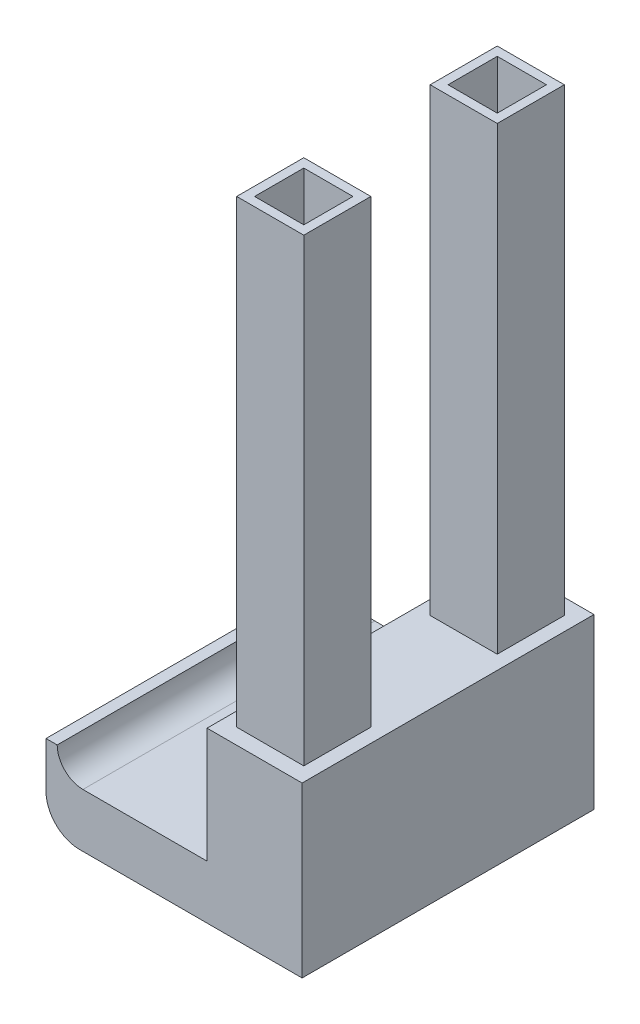
ISO-10303-21;
HEADER;
FILE_DESCRIPTION(('STEP AP214'),'2;1');
FILE_NAME('part.step','',(''),(''),'','','');
FILE_SCHEMA(('AUTOMOTIVE_DESIGN { 1 0 10303 214 1 1 1 1 }'));
ENDSEC;
DATA;
#1=APPLICATION_CONTEXT('core data for automotive mechanical design processes');
#2=APPLICATION_PROTOCOL_DEFINITION('international standard','automotive_design',2000,#1);
#3=PRODUCT_CONTEXT('',#1,'mechanical');
#4=PRODUCT('Part','Part','',(#3));
#5=PRODUCT_RELATED_PRODUCT_CATEGORY('part','',(#4));
#6=PRODUCT_DEFINITION_FORMATION('','',#4);
#7=PRODUCT_DEFINITION_CONTEXT('part definition',#1,'design');
#8=PRODUCT_DEFINITION('design','',#6,#7);
#9=PRODUCT_DEFINITION_SHAPE('','',#8);
#10=(LENGTH_UNIT() NAMED_UNIT(*) SI_UNIT(.MILLI.,.METRE.));
#11=(NAMED_UNIT(*) PLANE_ANGLE_UNIT() SI_UNIT($,.RADIAN.));
#12=(NAMED_UNIT(*) SI_UNIT($,.STERADIAN.) SOLID_ANGLE_UNIT());
#13=UNCERTAINTY_MEASURE_WITH_UNIT(LENGTH_MEASURE(1.E-05),#10,'distance_accuracy_value','');
#14=(GEOMETRIC_REPRESENTATION_CONTEXT(3) GLOBAL_UNCERTAINTY_ASSIGNED_CONTEXT((#13)) GLOBAL_UNIT_ASSIGNED_CONTEXT((#10,
#11,#12)) REPRESENTATION_CONTEXT('',''));
#15=CARTESIAN_POINT('',(0.,0.,0.));
#16=DIRECTION('',(0.,0.,1.));
#17=DIRECTION('',(1.,0.,0.));
#18=AXIS2_PLACEMENT_3D('',#15,#16,#17);
#19=CARTESIAN_POINT('',(0.,19.177,16.5735));
#20=DIRECTION('',(0.,-1.,0.));
#21=DIRECTION('',(0.,0.,-1.));
#22=AXIS2_PLACEMENT_3D('',#19,#20,#21);
#23=PLANE('',#22);
#24=DIRECTION('',(-1.,0.,0.));
#25=VECTOR('',#24,1.);
#26=CARTESIAN_POINT('',(0.,19.177,-16.5735));
#27=LINE('',#26,#25);
#28=CARTESIAN_POINT('',(0.,19.177,-16.5735));
#29=VERTEX_POINT('',#28);
#30=CARTESIAN_POINT('',(-10.795,19.177,-16.5735));
#31=VERTEX_POINT('',#30);
#32=EDGE_CURVE('E429',#29,#31,#27,.T.);
#33=ORIENTED_EDGE('',*,*,#32,.T.);
#34=DIRECTION('',(0.,0.,-1.));
#35=VECTOR('',#34,1.);
#36=CARTESIAN_POINT('',(-10.795,19.177,16.5735));
#37=LINE('',#36,#35);
#38=CARTESIAN_POINT('',(-10.795,19.177,16.5735));
#39=VERTEX_POINT('',#38);
#40=EDGE_CURVE('E472',#39,#31,#37,.T.);
#41=ORIENTED_EDGE('',*,*,#40,.F.);
#42=DIRECTION('',(-1.,0.,0.));
#43=VECTOR('',#42,1.);
#44=CARTESIAN_POINT('',(0.,19.177,16.5735));
#45=LINE('',#44,#43);
#46=CARTESIAN_POINT('',(0.,19.177,16.5735));
#47=VERTEX_POINT('',#46);
#48=EDGE_CURVE('E401',#47,#39,#45,.T.);
#49=ORIENTED_EDGE('',*,*,#48,.F.);
#50=DIRECTION('',(0.,0.,-1.));
#51=VECTOR('',#50,1.);
#52=CARTESIAN_POINT('',(0.,19.177,16.5735));
#53=LINE('',#52,#51);
#54=EDGE_CURVE('E54',#47,#29,#53,.T.);
#55=ORIENTED_EDGE('',*,*,#54,.T.);
#56=EDGE_LOOP('',(#33,#41,#49,#55));
#57=FACE_BOUND('',#56,.T.);
#58=DIRECTION('',(1.,0.,0.));
#59=VECTOR('',#58,1.);
#60=CARTESIAN_POINT('',(-9.2075,19.177,14.7955));
#61=LINE('',#60,#59);
#62=CARTESIAN_POINT('',(-9.2075,19.177,14.7955));
#63=VERTEX_POINT('',#62);
#64=CARTESIAN_POINT('',(-1.5875,19.177,14.7955));
#65=VERTEX_POINT('',#64);
#66=EDGE_CURVE('E337',#63,#65,#61,.T.);
#67=ORIENTED_EDGE('',*,*,#66,.F.);
#68=DIRECTION('',(0.,0.,1.));
#69=VECTOR('',#68,1.);
#70=CARTESIAN_POINT('',(-9.2075,19.177,14.7955));
#71=LINE('',#70,#69);
#72=CARTESIAN_POINT('',(-9.2075,19.177,7.1755));
#73=VERTEX_POINT('',#72);
#74=EDGE_CURVE('E324',#73,#63,#71,.T.);
#75=ORIENTED_EDGE('',*,*,#74,.F.);
#76=DIRECTION('',(-1.,0.,0.));
#77=VECTOR('',#76,1.);
#78=CARTESIAN_POINT('',(-9.2075,19.177,7.1755));
#79=LINE('',#78,#77);
#80=CARTESIAN_POINT('',(-1.5875,19.177,7.1755));
#81=VERTEX_POINT('',#80);
#82=EDGE_CURVE('E328',#81,#73,#79,.T.);
#83=ORIENTED_EDGE('',*,*,#82,.F.);
#84=DIRECTION('',(0.,0.,-1.));
#85=VECTOR('',#84,1.);
#86=CARTESIAN_POINT('',(-1.5875,19.177,14.7955));
#87=LINE('',#86,#85);
#88=EDGE_CURVE('E333',#65,#81,#87,.T.);
#89=ORIENTED_EDGE('',*,*,#88,.F.);
#90=EDGE_LOOP('',(#67,#75,#83,#89));
#91=FACE_BOUND('',#90,.T.);
#92=DIRECTION('',(0.,0.,1.));
#93=VECTOR('',#92,1.);
#94=CARTESIAN_POINT('',(-9.2075,19.177,-14.7955));
#95=LINE('',#94,#93);
#96=CARTESIAN_POINT('',(-9.2075,19.177,-14.7955));
#97=VERTEX_POINT('',#96);
#98=CARTESIAN_POINT('',(-9.2075,19.177,-7.1755));
#99=VERTEX_POINT('',#98);
#100=EDGE_CURVE('E232',#97,#99,#95,.T.);
#101=ORIENTED_EDGE('',*,*,#100,.F.);
#102=DIRECTION('',(-1.,0.,0.));
#103=VECTOR('',#102,1.);
#104=CARTESIAN_POINT('',(-9.2075,19.177,-14.7955));
#105=LINE('',#104,#103);
#106=CARTESIAN_POINT('',(-1.5875,19.177,-14.7955));
#107=VERTEX_POINT('',#106);
#108=EDGE_CURVE('E272',#107,#97,#105,.T.);
#109=ORIENTED_EDGE('',*,*,#108,.F.);
#110=DIRECTION('',(0.,0.,-1.));
#111=VECTOR('',#110,1.);
#112=CARTESIAN_POINT('',(-1.5875,19.177,-14.7955));
#113=LINE('',#112,#111);
#114=CARTESIAN_POINT('',(-1.5875,19.177,-7.1755));
#115=VERTEX_POINT('',#114);
#116=EDGE_CURVE('E66',#115,#107,#113,.T.);
#117=ORIENTED_EDGE('',*,*,#116,.F.);
#118=DIRECTION('',(1.,0.,0.));
#119=VECTOR('',#118,1.);
#120=CARTESIAN_POINT('',(-9.2075,19.177,-7.1755));
#121=LINE('',#120,#119);
#122=EDGE_CURVE('E61',#99,#115,#121,.T.);
#123=ORIENTED_EDGE('',*,*,#122,.F.);
#124=EDGE_LOOP('',(#101,#109,#117,#123));
#125=FACE_BOUND('',#124,.T.);
#126=ADVANCED_FACE('F45',(#57,#91,#125),#23,.F.);
#127=CARTESIAN_POINT('',(0.,0.,16.5735));
#128=DIRECTION('',(0.,1.,0.));
#129=DIRECTION('',(-1.,0.,0.));
#130=AXIS2_PLACEMENT_3D('',#127,#128,#129);
#131=PLANE('',#130);
#132=DIRECTION('',(1.,0.,0.));
#133=VECTOR('',#132,1.);
#134=CARTESIAN_POINT('',(0.,0.,-16.5735));
#135=LINE('',#134,#133);
#136=CARTESIAN_POINT('',(-25.273,0.,-16.5735));
#137=VERTEX_POINT('',#136);
#138=CARTESIAN_POINT('',(0.,0.,-16.5735));
#139=VERTEX_POINT('',#138);
#140=EDGE_CURVE('E306',#137,#139,#135,.T.);
#141=ORIENTED_EDGE('',*,*,#140,.T.);
#142=DIRECTION('',(0.,0.,-1.));
#143=VECTOR('',#142,1.);
#144=CARTESIAN_POINT('',(0.,0.,16.5735));
#145=LINE('',#144,#143);
#146=CARTESIAN_POINT('',(0.,0.,16.5735));
#147=VERTEX_POINT('',#146);
#148=EDGE_CURVE('E11',#147,#139,#145,.T.);
#149=ORIENTED_EDGE('',*,*,#148,.F.);
#150=DIRECTION('',(1.,0.,0.));
#151=VECTOR('',#150,1.);
#152=CARTESIAN_POINT('',(0.,0.,16.5735));
#153=LINE('',#152,#151);
#154=CARTESIAN_POINT('',(-25.273,0.,16.5735));
#155=VERTEX_POINT('',#154);
#156=EDGE_CURVE('E393',#155,#147,#153,.T.);
#157=ORIENTED_EDGE('',*,*,#156,.F.);
#158=DIRECTION('',(0.,0.,-1.));
#159=VECTOR('',#158,1.);
#160=CARTESIAN_POINT('',(-25.273,0.,16.5735));
#161=LINE('',#160,#159);
#162=EDGE_CURVE('E422',#155,#137,#161,.T.);
#163=ORIENTED_EDGE('',*,*,#162,.T.);
#164=EDGE_LOOP('',(#141,#149,#157,#163));
#165=FACE_BOUND('',#164,.T.);
#166=ADVANCED_FACE('F47',(#165),#131,.F.);
#167=CARTESIAN_POINT('',(0.,0.,16.5735));
#168=DIRECTION('',(-1.,0.,0.));
#169=DIRECTION('',(0.,0.,1.));
#170=AXIS2_PLACEMENT_3D('',#167,#168,#169);
#171=PLANE('',#170);
#172=DIRECTION('',(0.,1.,0.));
#173=VECTOR('',#172,1.);
#174=CARTESIAN_POINT('',(0.,0.,-16.5735));
#175=LINE('',#174,#173);
#176=EDGE_CURVE('E426',#139,#29,#175,.T.);
#177=ORIENTED_EDGE('',*,*,#176,.T.);
#178=ORIENTED_EDGE('',*,*,#54,.F.);
#179=DIRECTION('',(0.,1.,0.));
#180=VECTOR('',#179,1.);
#181=CARTESIAN_POINT('',(0.,0.,16.5735));
#182=LINE('',#181,#180);
#183=EDGE_CURVE('E397',#147,#47,#182,.T.);
#184=ORIENTED_EDGE('',*,*,#183,.F.);
#185=ORIENTED_EDGE('',*,*,#148,.T.);
#186=EDGE_LOOP('',(#177,#178,#184,#185));
#187=FACE_BOUND('',#186,.T.);
#188=ADVANCED_FACE('F504',(#187),#171,.F.);
#189=CARTESIAN_POINT('',(-10.795,6.096,16.5735));
#190=DIRECTION('',(1.,0.,0.));
#191=DIRECTION('',(0.,0.,-1.));
#192=AXIS2_PLACEMENT_3D('',#189,#190,#191);
#193=PLANE('',#192);
#194=DIRECTION('',(0.,-1.,0.));
#195=VECTOR('',#194,1.);
#196=CARTESIAN_POINT('',(-10.795,6.096,-16.5735));
#197=LINE('',#196,#195);
#198=CARTESIAN_POINT('',(-10.795,6.096,-16.5735));
#199=VERTEX_POINT('',#198);
#200=EDGE_CURVE('E432',#31,#199,#197,.T.);
#201=ORIENTED_EDGE('',*,*,#200,.T.);
#202=DIRECTION('',(0.,0.,-1.));
#203=VECTOR('',#202,1.);
#204=CARTESIAN_POINT('',(-10.795,6.096,16.5735));
#205=LINE('',#204,#203);
#206=CARTESIAN_POINT('',(-10.795,6.096,16.5735));
#207=VERTEX_POINT('',#206);
#208=EDGE_CURVE('E468',#207,#199,#205,.T.);
#209=ORIENTED_EDGE('',*,*,#208,.F.);
#210=DIRECTION('',(0.,-1.,0.));
#211=VECTOR('',#210,1.);
#212=CARTESIAN_POINT('',(-10.795,6.096,16.5735));
#213=LINE('',#212,#211);
#214=EDGE_CURVE('E404',#39,#207,#213,.T.);
#215=ORIENTED_EDGE('',*,*,#214,.F.);
#216=ORIENTED_EDGE('',*,*,#40,.T.);
#217=EDGE_LOOP('',(#201,#209,#215,#216));
#218=FACE_BOUND('',#217,.T.);
#219=ADVANCED_FACE('F492',(#218),#193,.F.);
#220=CARTESIAN_POINT('',(-10.795,6.096,16.5735));
#221=DIRECTION('',(0.,-1.,0.));
#222=DIRECTION('',(0.,0.,-1.));
#223=AXIS2_PLACEMENT_3D('',#220,#221,#222);
#224=PLANE('',#223);
#225=DIRECTION('',(-1.,0.,0.));
#226=VECTOR('',#225,1.);
#227=CARTESIAN_POINT('',(-10.795,6.096,-16.5735));
#228=LINE('',#227,#226);
#229=CARTESIAN_POINT('',(-24.892,6.096,-16.5735));
#230=VERTEX_POINT('',#229);
#231=EDGE_CURVE('E435',#199,#230,#228,.T.);
#232=ORIENTED_EDGE('',*,*,#231,.T.);
#233=DIRECTION('',(0.,0.,-1.));
#234=VECTOR('',#233,1.);
#235=CARTESIAN_POINT('',(-24.892,6.096,16.5735));
#236=LINE('',#235,#234);
#237=CARTESIAN_POINT('',(-24.892,6.096,16.5735));
#238=VERTEX_POINT('',#237);
#239=EDGE_CURVE('E464',#238,#230,#236,.T.);
#240=ORIENTED_EDGE('',*,*,#239,.F.);
#241=DIRECTION('',(-1.,0.,0.));
#242=VECTOR('',#241,1.);
#243=CARTESIAN_POINT('',(-10.795,6.096,16.5735));
#244=LINE('',#243,#242);
#245=EDGE_CURVE('E407',#207,#238,#244,.T.);
#246=ORIENTED_EDGE('',*,*,#245,.F.);
#247=ORIENTED_EDGE('',*,*,#208,.T.);
#248=EDGE_LOOP('',(#232,#240,#246,#247));
#249=FACE_BOUND('',#248,.T.);
#250=ADVANCED_FACE('F496',(#249),#224,.F.);
#251=CARTESIAN_POINT('',(-24.892,9.017,16.5735));
#252=DIRECTION('',(0.,0.,-1.));
#253=DIRECTION('',(-1.,0.,0.));
#254=AXIS2_PLACEMENT_3D('',#251,#252,#253);
#255=CYLINDRICAL_SURFACE('',#254,2.921);
#256=CARTESIAN_POINT('',(-24.892,9.017,-16.5735));
#257=DIRECTION('',(0.,0.,-1.));
#258=DIRECTION('',(1.,0.,0.));
#259=AXIS2_PLACEMENT_3D('',#256,#257,#258);
#260=CIRCLE('',#259,2.921);
#261=CARTESIAN_POINT('',(-27.813,9.017,-16.5735));
#262=VERTEX_POINT('',#261);
#263=EDGE_CURVE('E438',#230,#262,#260,.T.);
#264=ORIENTED_EDGE('',*,*,#263,.T.);
#265=DIRECTION('',(0.,0.,-1.));
#266=VECTOR('',#265,1.);
#267=CARTESIAN_POINT('',(-27.813,9.017,16.5735));
#268=LINE('',#267,#266);
#269=CARTESIAN_POINT('',(-27.813,9.017,16.5735));
#270=VERTEX_POINT('',#269);
#271=EDGE_CURVE('E460',#270,#262,#268,.T.);
#272=ORIENTED_EDGE('',*,*,#271,.F.);
#273=CARTESIAN_POINT('',(-24.892,9.017,16.5735));
#274=DIRECTION('',(0.,0.,-1.));
#275=DIRECTION('',(1.,0.,0.));
#276=AXIS2_PLACEMENT_3D('',#273,#274,#275);
#277=CIRCLE('',#276,2.921);
#278=EDGE_CURVE('E410',#238,#270,#277,.T.);
#279=ORIENTED_EDGE('',*,*,#278,.F.);
#280=ORIENTED_EDGE('',*,*,#239,.T.);
#281=EDGE_LOOP('',(#264,#272,#279,#280));
#282=FACE_BOUND('',#281,.T.);
#283=ADVANCED_FACE('F522',(#282),#255,.F.);
#284=CARTESIAN_POINT('',(-27.813,9.017,16.5735));
#285=DIRECTION('',(0.,-1.,0.));
#286=DIRECTION('',(0.,0.,-1.));
#287=AXIS2_PLACEMENT_3D('',#284,#285,#286);
#288=PLANE('',#287);
#289=DIRECTION('',(-1.,0.,0.));
#290=VECTOR('',#289,1.);
#291=CARTESIAN_POINT('',(-27.813,9.017,-16.5735));
#292=LINE('',#291,#290);
#293=CARTESIAN_POINT('',(-29.083,9.017,-16.5735));
#294=VERTEX_POINT('',#293);
#295=EDGE_CURVE('E441',#262,#294,#292,.T.);
#296=ORIENTED_EDGE('',*,*,#295,.T.);
#297=DIRECTION('',(0.,0.,-1.));
#298=VECTOR('',#297,1.);
#299=CARTESIAN_POINT('',(-29.083,9.017,16.5735));
#300=LINE('',#299,#298);
#301=CARTESIAN_POINT('',(-29.083,9.017,16.5735));
#302=VERTEX_POINT('',#301);
#303=EDGE_CURVE('E456',#302,#294,#300,.T.);
#304=ORIENTED_EDGE('',*,*,#303,.F.);
#305=DIRECTION('',(-1.,0.,0.));
#306=VECTOR('',#305,1.);
#307=CARTESIAN_POINT('',(-27.813,9.017,16.5735));
#308=LINE('',#307,#306);
#309=EDGE_CURVE('E413',#270,#302,#308,.T.);
#310=ORIENTED_EDGE('',*,*,#309,.F.);
#311=ORIENTED_EDGE('',*,*,#271,.T.);
#312=EDGE_LOOP('',(#296,#304,#310,#311));
#313=FACE_BOUND('',#312,.T.);
#314=ADVANCED_FACE('F520',(#313),#288,.F.);
#315=CARTESIAN_POINT('',(-29.083,9.017,16.5735));
#316=DIRECTION('',(1.,0.,0.));
#317=DIRECTION('',(0.,1.,0.));
#318=AXIS2_PLACEMENT_3D('',#315,#316,#317);
#319=PLANE('',#318);
#320=DIRECTION('',(0.,-1.,0.));
#321=VECTOR('',#320,1.);
#322=CARTESIAN_POINT('',(-29.083,9.017,-16.5735));
#323=LINE('',#322,#321);
#324=CARTESIAN_POINT('',(-29.083,3.81000000000002,-16.5735));
#325=VERTEX_POINT('',#324);
#326=EDGE_CURVE('E444',#294,#325,#323,.T.);
#327=ORIENTED_EDGE('',*,*,#326,.T.);
#328=DIRECTION('',(0.,0.,-1.));
#329=VECTOR('',#328,1.);
#330=CARTESIAN_POINT('',(-29.083,3.81000000000002,16.5735));
#331=LINE('',#330,#329);
#332=CARTESIAN_POINT('',(-29.083,3.81000000000002,16.5735));
#333=VERTEX_POINT('',#332);
#334=EDGE_CURVE('E452',#333,#325,#331,.T.);
#335=ORIENTED_EDGE('',*,*,#334,.F.);
#336=DIRECTION('',(0.,-1.,0.));
#337=VECTOR('',#336,1.);
#338=CARTESIAN_POINT('',(-29.083,9.017,16.5735));
#339=LINE('',#338,#337);
#340=EDGE_CURVE('E416',#302,#333,#339,.T.);
#341=ORIENTED_EDGE('',*,*,#340,.F.);
#342=ORIENTED_EDGE('',*,*,#303,.T.);
#343=EDGE_LOOP('',(#327,#335,#341,#342));
#344=FACE_BOUND('',#343,.T.);
#345=ADVANCED_FACE('F516',(#344),#319,.F.);
#346=CARTESIAN_POINT('',(-25.273,3.81,16.5735));
#347=DIRECTION('',(0.,0.,-1.));
#348=DIRECTION('',(-1.,0.,0.));
#349=AXIS2_PLACEMENT_3D('',#346,#347,#348);
#350=CYLINDRICAL_SURFACE('',#349,3.81);
#351=CARTESIAN_POINT('',(-25.273,3.81,-16.5735));
#352=DIRECTION('',(0.,0.,1.));
#353=DIRECTION('',(-1.,0.,0.));
#354=AXIS2_PLACEMENT_3D('',#351,#352,#353);
#355=CIRCLE('',#354,3.81);
#356=EDGE_CURVE('E398',#325,#137,#355,.T.);
#357=ORIENTED_EDGE('',*,*,#356,.T.);
#358=ORIENTED_EDGE('',*,*,#162,.F.);
#359=CARTESIAN_POINT('',(-25.273,3.81,16.5735));
#360=DIRECTION('',(0.,0.,1.));
#361=DIRECTION('',(-1.,0.,0.));
#362=AXIS2_PLACEMENT_3D('',#359,#360,#361);
#363=CIRCLE('',#362,3.81);
#364=EDGE_CURVE('E419',#333,#155,#363,.T.);
#365=ORIENTED_EDGE('',*,*,#364,.F.);
#366=ORIENTED_EDGE('',*,*,#334,.T.);
#367=EDGE_LOOP('',(#357,#358,#365,#366));
#368=FACE_BOUND('',#367,.T.);
#369=ADVANCED_FACE('F511',(#368),#350,.T.);
#370=CARTESIAN_POINT('',(-25.273,3.81,16.5735));
#371=DIRECTION('',(0.,0.,-1.));
#372=DIRECTION('',(-1.,0.,0.));
#373=AXIS2_PLACEMENT_3D('',#370,#371,#372);
#374=PLANE('',#373);
#375=ORIENTED_EDGE('',*,*,#156,.T.);
#376=ORIENTED_EDGE('',*,*,#183,.T.);
#377=ORIENTED_EDGE('',*,*,#48,.T.);
#378=ORIENTED_EDGE('',*,*,#214,.T.);
#379=ORIENTED_EDGE('',*,*,#245,.T.);
#380=ORIENTED_EDGE('',*,*,#278,.T.);
#381=ORIENTED_EDGE('',*,*,#309,.T.);
#382=ORIENTED_EDGE('',*,*,#340,.T.);
#383=ORIENTED_EDGE('',*,*,#364,.T.);
#384=EDGE_LOOP('',(#375,#376,#377,#378,#379,#380,#381,#382,#383));
#385=FACE_BOUND('',#384,.T.);
#386=ADVANCED_FACE('F500',(#385),#374,.F.);
#387=CARTESIAN_POINT('',(-25.273,3.81,-16.5735));
#388=DIRECTION('',(0.,0.,-1.));
#389=DIRECTION('',(-1.,0.,0.));
#390=AXIS2_PLACEMENT_3D('',#387,#388,#389);
#391=PLANE('',#390);
#392=ORIENTED_EDGE('',*,*,#140,.F.);
#393=ORIENTED_EDGE('',*,*,#356,.F.);
#394=ORIENTED_EDGE('',*,*,#326,.F.);
#395=ORIENTED_EDGE('',*,*,#295,.F.);
#396=ORIENTED_EDGE('',*,*,#263,.F.);
#397=ORIENTED_EDGE('',*,*,#231,.F.);
#398=ORIENTED_EDGE('',*,*,#200,.F.);
#399=ORIENTED_EDGE('',*,*,#32,.F.);
#400=ORIENTED_EDGE('',*,*,#176,.F.);
#401=EDGE_LOOP('',(#392,#393,#394,#395,#396,#397,#398,#399,#400));
#402=FACE_BOUND('',#401,.T.);
#403=ADVANCED_FACE('F487',(#402),#391,.T.);
#404=CARTESIAN_POINT('',(0.,71.374,0.));
#405=DIRECTION('',(0.,1.,0.));
#406=DIRECTION('',(0.,0.,1.));
#407=AXIS2_PLACEMENT_3D('',#404,#405,#406);
#408=PLANE('',#407);
#409=DIRECTION('',(1.,0.,0.));
#410=VECTOR('',#409,1.);
#411=CARTESIAN_POINT('',(-9.2075,71.374,14.7955));
#412=LINE('',#411,#410);
#413=CARTESIAN_POINT('',(-9.2075,71.374,14.7955));
#414=VERTEX_POINT('',#413);
#415=CARTESIAN_POINT('',(-1.5875,71.374,14.7955));
#416=VERTEX_POINT('',#415);
#417=EDGE_CURVE('E329',#414,#416,#412,.T.);
#418=ORIENTED_EDGE('',*,*,#417,.T.);
#419=DIRECTION('',(0.,0.,-1.));
#420=VECTOR('',#419,1.);
#421=CARTESIAN_POINT('',(-1.5875,71.374,14.7955));
#422=LINE('',#421,#420);
#423=CARTESIAN_POINT('',(-1.5875,71.374,7.1755));
#424=VERTEX_POINT('',#423);
#425=EDGE_CURVE('E347',#416,#424,#422,.T.);
#426=ORIENTED_EDGE('',*,*,#425,.T.);
#427=DIRECTION('',(-1.,0.,0.));
#428=VECTOR('',#427,1.);
#429=CARTESIAN_POINT('',(-9.2075,71.374,7.1755));
#430=LINE('',#429,#428);
#431=CARTESIAN_POINT('',(-9.2075,71.374,7.1755));
#432=VERTEX_POINT('',#431);
#433=EDGE_CURVE('E344',#424,#432,#430,.T.);
#434=ORIENTED_EDGE('',*,*,#433,.T.);
#435=DIRECTION('',(0.,0.,1.));
#436=VECTOR('',#435,1.);
#437=CARTESIAN_POINT('',(-9.2075,71.374,14.7955));
#438=LINE('',#437,#436);
#439=EDGE_CURVE('E323',#432,#414,#438,.T.);
#440=ORIENTED_EDGE('',*,*,#439,.T.);
#441=EDGE_LOOP('',(#418,#426,#434,#440));
#442=FACE_BOUND('',#441,.T.);
#443=DIRECTION('',(0.,0.,-1.));
#444=VECTOR('',#443,1.);
#445=CARTESIAN_POINT('',(-2.6035,71.374,13.7795));
#446=LINE('',#445,#444);
#447=CARTESIAN_POINT('',(-2.6035,71.374,13.7795));
#448=VERTEX_POINT('',#447);
#449=CARTESIAN_POINT('',(-2.6035,71.374,8.1915));
#450=VERTEX_POINT('',#449);
#451=EDGE_CURVE('E388',#448,#450,#446,.T.);
#452=ORIENTED_EDGE('',*,*,#451,.F.);
#453=DIRECTION('',(1.,0.,0.));
#454=VECTOR('',#453,1.);
#455=CARTESIAN_POINT('',(-8.1915,71.374,13.7795));
#456=LINE('',#455,#454);
#457=CARTESIAN_POINT('',(-8.1915,71.374,13.7795));
#458=VERTEX_POINT('',#457);
#459=EDGE_CURVE('E371',#458,#448,#456,.T.);
#460=ORIENTED_EDGE('',*,*,#459,.F.);
#461=DIRECTION('',(0.,0.,1.));
#462=VECTOR('',#461,1.);
#463=CARTESIAN_POINT('',(-8.1915,71.374,13.7795));
#464=LINE('',#463,#462);
#465=CARTESIAN_POINT('',(-8.1915,71.374,8.1915));
#466=VERTEX_POINT('',#465);
#467=EDGE_CURVE('E365',#466,#458,#464,.T.);
#468=ORIENTED_EDGE('',*,*,#467,.F.);
#469=DIRECTION('',(-1.,0.,0.));
#470=VECTOR('',#469,1.);
#471=CARTESIAN_POINT('',(-8.1915,71.374,8.1915));
#472=LINE('',#471,#470);
#473=EDGE_CURVE('E384',#450,#466,#472,.T.);
#474=ORIENTED_EDGE('',*,*,#473,.F.);
#475=EDGE_LOOP('',(#452,#460,#468,#474));
#476=FACE_BOUND('',#475,.T.);
#477=ADVANCED_FACE('F569',(#442,#476),#408,.T.);
#478=CARTESIAN_POINT('',(-9.2075,71.374,14.7955));
#479=DIRECTION('',(0.,0.,-1.));
#480=DIRECTION('',(-1.,0.,0.));
#481=AXIS2_PLACEMENT_3D('',#478,#479,#480);
#482=PLANE('',#481);
#483=ORIENTED_EDGE('',*,*,#66,.T.);
#484=DIRECTION('',(0.,-1.,0.));
#485=VECTOR('',#484,1.);
#486=CARTESIAN_POINT('',(-1.5875,71.374,14.7955));
#487=LINE('',#486,#485);
#488=EDGE_CURVE('E307',#416,#65,#487,.T.);
#489=ORIENTED_EDGE('',*,*,#488,.F.);
#490=ORIENTED_EDGE('',*,*,#417,.F.);
#491=DIRECTION('',(0.,-1.,0.));
#492=VECTOR('',#491,1.);
#493=CARTESIAN_POINT('',(-9.2075,71.374,14.7955));
#494=LINE('',#493,#492);
#495=EDGE_CURVE('E319',#414,#63,#494,.T.);
#496=ORIENTED_EDGE('',*,*,#495,.T.);
#497=EDGE_LOOP('',(#483,#489,#490,#496));
#498=FACE_BOUND('',#497,.T.);
#499=ADVANCED_FACE('F626',(#498),#482,.F.);
#500=CARTESIAN_POINT('',(-1.5875,71.374,14.7955));
#501=DIRECTION('',(-1.,0.,0.));
#502=DIRECTION('',(0.,0.,1.));
#503=AXIS2_PLACEMENT_3D('',#500,#501,#502);
#504=PLANE('',#503);
#505=ORIENTED_EDGE('',*,*,#88,.T.);
#506=DIRECTION('',(0.,-1.,0.));
#507=VECTOR('',#506,1.);
#508=CARTESIAN_POINT('',(-1.5875,71.374,7.1755));
#509=LINE('',#508,#507);
#510=EDGE_CURVE('E311',#424,#81,#509,.T.);
#511=ORIENTED_EDGE('',*,*,#510,.F.);
#512=ORIENTED_EDGE('',*,*,#425,.F.);
#513=ORIENTED_EDGE('',*,*,#488,.T.);
#514=EDGE_LOOP('',(#505,#511,#512,#513));
#515=FACE_BOUND('',#514,.T.);
#516=ADVANCED_FACE('F636',(#515),#504,.F.);
#517=CARTESIAN_POINT('',(-9.2075,71.374,7.1755));
#518=DIRECTION('',(0.,0.,1.));
#519=DIRECTION('',(1.,0.,0.));
#520=AXIS2_PLACEMENT_3D('',#517,#518,#519);
#521=PLANE('',#520);
#522=ORIENTED_EDGE('',*,*,#82,.T.);
#523=DIRECTION('',(0.,-1.,0.));
#524=VECTOR('',#523,1.);
#525=CARTESIAN_POINT('',(-9.2075,71.374,7.1755));
#526=LINE('',#525,#524);
#527=EDGE_CURVE('E315',#432,#73,#526,.T.);
#528=ORIENTED_EDGE('',*,*,#527,.F.);
#529=ORIENTED_EDGE('',*,*,#433,.F.);
#530=ORIENTED_EDGE('',*,*,#510,.T.);
#531=EDGE_LOOP('',(#522,#528,#529,#530));
#532=FACE_BOUND('',#531,.T.);
#533=ADVANCED_FACE('F646',(#532),#521,.F.);
#534=CARTESIAN_POINT('',(-9.2075,71.374,14.7955));
#535=DIRECTION('',(1.,0.,0.));
#536=DIRECTION('',(0.,0.,-1.));
#537=AXIS2_PLACEMENT_3D('',#534,#535,#536);
#538=PLANE('',#537);
#539=ORIENTED_EDGE('',*,*,#74,.T.);
#540=ORIENTED_EDGE('',*,*,#495,.F.);
#541=ORIENTED_EDGE('',*,*,#439,.F.);
#542=ORIENTED_EDGE('',*,*,#527,.T.);
#543=EDGE_LOOP('',(#539,#540,#541,#542));
#544=FACE_BOUND('',#543,.T.);
#545=ADVANCED_FACE('F656',(#544),#538,.F.);
#546=CARTESIAN_POINT('',(-8.1915,71.374,13.7795));
#547=DIRECTION('',(0.,0.,-1.));
#548=DIRECTION('',(-1.,0.,0.));
#549=AXIS2_PLACEMENT_3D('',#546,#547,#548);
#550=PLANE('',#549);
#551=DIRECTION('',(1.,0.,0.));
#552=VECTOR('',#551,1.);
#553=CARTESIAN_POINT('',(-8.1915,19.177,13.7795));
#554=LINE('',#553,#552);
#555=CARTESIAN_POINT('',(-8.1915,19.177,13.7795));
#556=VERTEX_POINT('',#555);
#557=CARTESIAN_POINT('',(-2.6035,19.177,13.7795));
#558=VERTEX_POINT('',#557);
#559=EDGE_CURVE('E250',#556,#558,#554,.T.);
#560=ORIENTED_EDGE('',*,*,#559,.F.);
#561=DIRECTION('',(0.,-1.,0.));
#562=VECTOR('',#561,1.);
#563=CARTESIAN_POINT('',(-8.1915,71.374,13.7795));
#564=LINE('',#563,#562);
#565=EDGE_CURVE('E362',#458,#556,#564,.T.);
#566=ORIENTED_EDGE('',*,*,#565,.F.);
#567=ORIENTED_EDGE('',*,*,#459,.T.);
#568=DIRECTION('',(0.,-1.,0.));
#569=VECTOR('',#568,1.);
#570=CARTESIAN_POINT('',(-2.6035,71.374,13.7795));
#571=LINE('',#570,#569);
#572=EDGE_CURVE('E341',#448,#558,#571,.T.);
#573=ORIENTED_EDGE('',*,*,#572,.T.);
#574=EDGE_LOOP('',(#560,#566,#567,#573));
#575=FACE_BOUND('',#574,.T.);
#576=ADVANCED_FACE('F561',(#575),#550,.T.);
#577=CARTESIAN_POINT('',(-2.6035,71.374,13.7795));
#578=DIRECTION('',(-1.,0.,0.));
#579=DIRECTION('',(0.,0.,1.));
#580=AXIS2_PLACEMENT_3D('',#577,#578,#579);
#581=PLANE('',#580);
#582=DIRECTION('',(0.,0.,-1.));
#583=VECTOR('',#582,1.);
#584=CARTESIAN_POINT('',(-2.6035,19.177,13.7795));
#585=LINE('',#584,#583);
#586=CARTESIAN_POINT('',(-2.6035,19.177,8.1915));
#587=VERTEX_POINT('',#586);
#588=EDGE_CURVE('E375',#558,#587,#585,.T.);
#589=ORIENTED_EDGE('',*,*,#588,.F.);
#590=ORIENTED_EDGE('',*,*,#572,.F.);
#591=ORIENTED_EDGE('',*,*,#451,.T.);
#592=DIRECTION('',(0.,-1.,0.));
#593=VECTOR('',#592,1.);
#594=CARTESIAN_POINT('',(-2.6035,71.374,8.1915));
#595=LINE('',#594,#593);
#596=EDGE_CURVE('E356',#450,#587,#595,.T.);
#597=ORIENTED_EDGE('',*,*,#596,.T.);
#598=EDGE_LOOP('',(#589,#590,#591,#597));
#599=FACE_BOUND('',#598,.T.);
#600=ADVANCED_FACE('F565',(#599),#581,.T.);
#601=CARTESIAN_POINT('',(-8.1915,71.374,8.1915));
#602=DIRECTION('',(0.,0.,1.));
#603=DIRECTION('',(1.,0.,0.));
#604=AXIS2_PLACEMENT_3D('',#601,#602,#603);
#605=PLANE('',#604);
#606=DIRECTION('',(-1.,0.,0.));
#607=VECTOR('',#606,1.);
#608=CARTESIAN_POINT('',(-8.1915,19.177,8.1915));
#609=LINE('',#608,#607);
#610=CARTESIAN_POINT('',(-8.1915,19.177,8.1915));
#611=VERTEX_POINT('',#610);
#612=EDGE_CURVE('E370',#587,#611,#609,.T.);
#613=ORIENTED_EDGE('',*,*,#612,.F.);
#614=ORIENTED_EDGE('',*,*,#596,.F.);
#615=ORIENTED_EDGE('',*,*,#473,.T.);
#616=DIRECTION('',(0.,-1.,0.));
#617=VECTOR('',#616,1.);
#618=CARTESIAN_POINT('',(-8.1915,71.374,8.1915));
#619=LINE('',#618,#617);
#620=EDGE_CURVE('E359',#466,#611,#619,.T.);
#621=ORIENTED_EDGE('',*,*,#620,.T.);
#622=EDGE_LOOP('',(#613,#614,#615,#621));
#623=FACE_BOUND('',#622,.T.);
#624=ADVANCED_FACE('F571',(#623),#605,.T.);
#625=CARTESIAN_POINT('',(-8.1915,71.374,13.7795));
#626=DIRECTION('',(1.,0.,0.));
#627=DIRECTION('',(0.,0.,-1.));
#628=AXIS2_PLACEMENT_3D('',#625,#626,#627);
#629=PLANE('',#628);
#630=DIRECTION('',(0.,0.,1.));
#631=VECTOR('',#630,1.);
#632=CARTESIAN_POINT('',(-8.1915,19.177,13.7795));
#633=LINE('',#632,#631);
#634=EDGE_CURVE('E366',#611,#556,#633,.T.);
#635=ORIENTED_EDGE('',*,*,#634,.F.);
#636=ORIENTED_EDGE('',*,*,#620,.F.);
#637=ORIENTED_EDGE('',*,*,#467,.T.);
#638=ORIENTED_EDGE('',*,*,#565,.T.);
#639=EDGE_LOOP('',(#635,#636,#637,#638));
#640=FACE_BOUND('',#639,.T.);
#641=ADVANCED_FACE('F556',(#640),#629,.T.);
#642=CARTESIAN_POINT('',(0.,71.374,0.));
#643=DIRECTION('',(0.,1.,0.));
#644=DIRECTION('',(0.,0.,1.));
#645=AXIS2_PLACEMENT_3D('',#642,#643,#644);
#646=PLANE('',#645);
#647=DIRECTION('',(0.,0.,1.));
#648=VECTOR('',#647,1.);
#649=CARTESIAN_POINT('',(-9.2075,71.374,-14.7955));
#650=LINE('',#649,#648);
#651=CARTESIAN_POINT('',(-9.2075,71.374,-14.7955));
#652=VERTEX_POINT('',#651);
#653=CARTESIAN_POINT('',(-9.2075,71.374,-7.1755));
#654=VERTEX_POINT('',#653);
#655=EDGE_CURVE('E267',#652,#654,#650,.T.);
#656=ORIENTED_EDGE('',*,*,#655,.T.);
#657=DIRECTION('',(1.,0.,0.));
#658=VECTOR('',#657,1.);
#659=CARTESIAN_POINT('',(-9.2075,71.374,-7.1755));
#660=LINE('',#659,#658);
#661=CARTESIAN_POINT('',(-1.5875,71.374,-7.1755));
#662=VERTEX_POINT('',#661);
#663=EDGE_CURVE('E271',#654,#662,#660,.T.);
#664=ORIENTED_EDGE('',*,*,#663,.T.);
#665=DIRECTION('',(0.,0.,-1.));
#666=VECTOR('',#665,1.);
#667=CARTESIAN_POINT('',(-1.5875,71.374,-14.7955));
#668=LINE('',#667,#666);
#669=CARTESIAN_POINT('',(-1.5875,71.374,-14.7955));
#670=VERTEX_POINT('',#669);
#671=EDGE_CURVE('E275',#662,#670,#668,.T.);
#672=ORIENTED_EDGE('',*,*,#671,.T.);
#673=DIRECTION('',(-1.,0.,0.));
#674=VECTOR('',#673,1.);
#675=CARTESIAN_POINT('',(-9.2075,71.374,-14.7955));
#676=LINE('',#675,#674);
#677=EDGE_CURVE('E278',#670,#652,#676,.T.);
#678=ORIENTED_EDGE('',*,*,#677,.T.);
#679=EDGE_LOOP('',(#656,#664,#672,#678));
#680=FACE_BOUND('',#679,.T.);
#681=DIRECTION('',(1.,0.,0.));
#682=VECTOR('',#681,1.);
#683=CARTESIAN_POINT('',(-8.1915,71.374,-8.1915));
#684=LINE('',#683,#682);
#685=CARTESIAN_POINT('',(-8.1915,71.374,-8.1915));
#686=VERTEX_POINT('',#685);
#687=CARTESIAN_POINT('',(-2.6035,71.374,-8.1915));
#688=VERTEX_POINT('',#687);
#689=EDGE_CURVE('E223',#686,#688,#684,.T.);
#690=ORIENTED_EDGE('',*,*,#689,.F.);
#691=DIRECTION('',(0.,0.,1.));
#692=VECTOR('',#691,1.);
#693=CARTESIAN_POINT('',(-8.1915,71.374,-13.7795));
#694=LINE('',#693,#692);
#695=CARTESIAN_POINT('',(-8.1915,71.374,-13.7795));
#696=VERTEX_POINT('',#695);
#697=EDGE_CURVE('E212',#696,#686,#694,.T.);
#698=ORIENTED_EDGE('',*,*,#697,.F.);
#699=DIRECTION('',(-1.,0.,0.));
#700=VECTOR('',#699,1.);
#701=CARTESIAN_POINT('',(-8.1915,71.374,-13.7795));
#702=LINE('',#701,#700);
#703=CARTESIAN_POINT('',(-2.6035,71.374,-13.7795));
#704=VERTEX_POINT('',#703);
#705=EDGE_CURVE('E242',#704,#696,#702,.T.);
#706=ORIENTED_EDGE('',*,*,#705,.F.);
#707=DIRECTION('',(0.,0.,-1.));
#708=VECTOR('',#707,1.);
#709=CARTESIAN_POINT('',(-2.6035,71.374,-13.7795));
#710=LINE('',#709,#708);
#711=EDGE_CURVE('E238',#688,#704,#710,.T.);
#712=ORIENTED_EDGE('',*,*,#711,.F.);
#713=EDGE_LOOP('',(#690,#698,#706,#712));
#714=FACE_BOUND('',#713,.T.);
#715=ADVANCED_FACE('F236',(#680,#714),#646,.T.);
#716=CARTESIAN_POINT('',(-9.2075,71.374,-14.7955));
#717=DIRECTION('',(1.,0.,0.));
#718=DIRECTION('',(0.,0.,-1.));
#719=AXIS2_PLACEMENT_3D('',#716,#717,#718);
#720=PLANE('',#719);
#721=ORIENTED_EDGE('',*,*,#100,.T.);
#722=DIRECTION('',(0.,-1.,0.));
#723=VECTOR('',#722,1.);
#724=CARTESIAN_POINT('',(-9.2075,71.374,-7.1755));
#725=LINE('',#724,#723);
#726=EDGE_CURVE('E303',#654,#99,#725,.T.);
#727=ORIENTED_EDGE('',*,*,#726,.F.);
#728=ORIENTED_EDGE('',*,*,#655,.F.);
#729=DIRECTION('',(0.,-1.,0.));
#730=VECTOR('',#729,1.);
#731=CARTESIAN_POINT('',(-9.2075,71.374,-14.7955));
#732=LINE('',#731,#730);
#733=EDGE_CURVE('E281',#652,#97,#732,.T.);
#734=ORIENTED_EDGE('',*,*,#733,.T.);
#735=EDGE_LOOP('',(#721,#727,#728,#734));
#736=FACE_BOUND('',#735,.T.);
#737=ADVANCED_FACE('F698',(#736),#720,.F.);
#738=CARTESIAN_POINT('',(-9.2075,71.374,-7.1755));
#739=DIRECTION('',(0.,0.,-1.));
#740=DIRECTION('',(-1.,0.,0.));
#741=AXIS2_PLACEMENT_3D('',#738,#739,#740);
#742=PLANE('',#741);
#743=ORIENTED_EDGE('',*,*,#122,.T.);
#744=DIRECTION('',(0.,-1.,0.));
#745=VECTOR('',#744,1.);
#746=CARTESIAN_POINT('',(-1.5875,71.374,-7.1755));
#747=LINE('',#746,#745);
#748=EDGE_CURVE('E299',#662,#115,#747,.T.);
#749=ORIENTED_EDGE('',*,*,#748,.F.);
#750=ORIENTED_EDGE('',*,*,#663,.F.);
#751=ORIENTED_EDGE('',*,*,#726,.T.);
#752=EDGE_LOOP('',(#743,#749,#750,#751));
#753=FACE_BOUND('',#752,.T.);
#754=ADVANCED_FACE('F708',(#753),#742,.F.);
#755=CARTESIAN_POINT('',(-1.5875,71.374,-14.7955));
#756=DIRECTION('',(-1.,0.,0.));
#757=DIRECTION('',(0.,0.,1.));
#758=AXIS2_PLACEMENT_3D('',#755,#756,#757);
#759=PLANE('',#758);
#760=ORIENTED_EDGE('',*,*,#116,.T.);
#761=DIRECTION('',(0.,-1.,0.));
#762=VECTOR('',#761,1.);
#763=CARTESIAN_POINT('',(-1.5875,71.374,-14.7955));
#764=LINE('',#763,#762);
#765=EDGE_CURVE('E295',#670,#107,#764,.T.);
#766=ORIENTED_EDGE('',*,*,#765,.F.);
#767=ORIENTED_EDGE('',*,*,#671,.F.);
#768=ORIENTED_EDGE('',*,*,#748,.T.);
#769=EDGE_LOOP('',(#760,#766,#767,#768));
#770=FACE_BOUND('',#769,.T.);
#771=ADVANCED_FACE('F718',(#770),#759,.F.);
#772=CARTESIAN_POINT('',(-9.2075,71.374,-14.7955));
#773=DIRECTION('',(0.,0.,1.));
#774=DIRECTION('',(1.,0.,0.));
#775=AXIS2_PLACEMENT_3D('',#772,#773,#774);
#776=PLANE('',#775);
#777=ORIENTED_EDGE('',*,*,#108,.T.);
#778=ORIENTED_EDGE('',*,*,#733,.F.);
#779=ORIENTED_EDGE('',*,*,#677,.F.);
#780=ORIENTED_EDGE('',*,*,#765,.T.);
#781=EDGE_LOOP('',(#777,#778,#779,#780));
#782=FACE_BOUND('',#781,.T.);
#783=ADVANCED_FACE('F728',(#782),#776,.F.);
#784=CARTESIAN_POINT('',(-8.1915,71.374,-13.7795));
#785=DIRECTION('',(1.,0.,0.));
#786=DIRECTION('',(0.,0.,-1.));
#787=AXIS2_PLACEMENT_3D('',#784,#785,#786);
#788=PLANE('',#787);
#789=DIRECTION('',(0.,0.,1.));
#790=VECTOR('',#789,1.);
#791=CARTESIAN_POINT('',(-8.1915,19.177,-13.7795));
#792=LINE('',#791,#790);
#793=CARTESIAN_POINT('',(-8.1915,19.177,-13.7795));
#794=VERTEX_POINT('',#793);
#795=CARTESIAN_POINT('',(-8.1915,19.177,-8.1915));
#796=VERTEX_POINT('',#795);
#797=EDGE_CURVE('E247',#794,#796,#792,.T.);
#798=ORIENTED_EDGE('',*,*,#797,.F.);
#799=DIRECTION('',(0.,-1.,0.));
#800=VECTOR('',#799,1.);
#801=CARTESIAN_POINT('',(-8.1915,71.374,-13.7795));
#802=LINE('',#801,#800);
#803=EDGE_CURVE('E218',#696,#794,#802,.T.);
#804=ORIENTED_EDGE('',*,*,#803,.F.);
#805=ORIENTED_EDGE('',*,*,#697,.T.);
#806=DIRECTION('',(0.,-1.,0.));
#807=VECTOR('',#806,1.);
#808=CARTESIAN_POINT('',(-8.1915,71.374,-8.1915));
#809=LINE('',#808,#807);
#810=EDGE_CURVE('E216',#686,#796,#809,.T.);
#811=ORIENTED_EDGE('',*,*,#810,.T.);
#812=EDGE_LOOP('',(#798,#804,#805,#811));
#813=FACE_BOUND('',#812,.T.);
#814=ADVANCED_FACE('F215',(#813),#788,.T.);
#815=CARTESIAN_POINT('',(-8.1915,71.374,-8.1915));
#816=DIRECTION('',(0.,0.,-1.));
#817=DIRECTION('',(-1.,0.,0.));
#818=AXIS2_PLACEMENT_3D('',#815,#816,#817);
#819=PLANE('',#818);
#820=DIRECTION('',(1.,0.,0.));
#821=VECTOR('',#820,1.);
#822=CARTESIAN_POINT('',(-8.1915,19.177,-8.1915));
#823=LINE('',#822,#821);
#824=CARTESIAN_POINT('',(-2.6035,19.177,-8.1915));
#825=VERTEX_POINT('',#824);
#826=EDGE_CURVE('E230',#796,#825,#823,.T.);
#827=ORIENTED_EDGE('',*,*,#826,.F.);
#828=ORIENTED_EDGE('',*,*,#810,.F.);
#829=ORIENTED_EDGE('',*,*,#689,.T.);
#830=DIRECTION('',(0.,-1.,0.));
#831=VECTOR('',#830,1.);
#832=CARTESIAN_POINT('',(-2.6035,71.374,-8.1915));
#833=LINE('',#832,#831);
#834=EDGE_CURVE('E233',#688,#825,#833,.T.);
#835=ORIENTED_EDGE('',*,*,#834,.T.);
#836=EDGE_LOOP('',(#827,#828,#829,#835));
#837=FACE_BOUND('',#836,.T.);
#838=ADVANCED_FACE('F227',(#837),#819,.T.);
#839=CARTESIAN_POINT('',(-2.6035,71.374,-13.7795));
#840=DIRECTION('',(-1.,0.,0.));
#841=DIRECTION('',(0.,0.,1.));
#842=AXIS2_PLACEMENT_3D('',#839,#840,#841);
#843=PLANE('',#842);
#844=DIRECTION('',(0.,0.,-1.));
#845=VECTOR('',#844,1.);
#846=CARTESIAN_POINT('',(-2.6035,19.177,-13.7795));
#847=LINE('',#846,#845);
#848=CARTESIAN_POINT('',(-2.6035,19.177,-13.7795));
#849=VERTEX_POINT('',#848);
#850=EDGE_CURVE('E253',#825,#849,#847,.T.);
#851=ORIENTED_EDGE('',*,*,#850,.F.);
#852=ORIENTED_EDGE('',*,*,#834,.F.);
#853=ORIENTED_EDGE('',*,*,#711,.T.);
#854=DIRECTION('',(0.,-1.,0.));
#855=VECTOR('',#854,1.);
#856=CARTESIAN_POINT('',(-2.6035,71.374,-13.7795));
#857=LINE('',#856,#855);
#858=EDGE_CURVE('E262',#704,#849,#857,.T.);
#859=ORIENTED_EDGE('',*,*,#858,.T.);
#860=EDGE_LOOP('',(#851,#852,#853,#859));
#861=FACE_BOUND('',#860,.T.);
#862=ADVANCED_FACE('F549',(#861),#843,.T.);
#863=CARTESIAN_POINT('',(-8.1915,71.374,-13.7795));
#864=DIRECTION('',(0.,0.,1.));
#865=DIRECTION('',(1.,0.,0.));
#866=AXIS2_PLACEMENT_3D('',#863,#864,#865);
#867=PLANE('',#866);
#868=DIRECTION('',(-1.,0.,0.));
#869=VECTOR('',#868,1.);
#870=CARTESIAN_POINT('',(-8.1915,19.177,-13.7795));
#871=LINE('',#870,#869);
#872=EDGE_CURVE('E224',#849,#794,#871,.T.);
#873=ORIENTED_EDGE('',*,*,#872,.F.);
#874=ORIENTED_EDGE('',*,*,#858,.F.);
#875=ORIENTED_EDGE('',*,*,#705,.T.);
#876=ORIENTED_EDGE('',*,*,#803,.T.);
#877=EDGE_LOOP('',(#873,#874,#875,#876));
#878=FACE_BOUND('',#877,.T.);
#879=ADVANCED_FACE('F544',(#878),#867,.T.);
#880=ORIENTED_EDGE('',*,*,#634,.T.);
#881=ORIENTED_EDGE('',*,*,#559,.T.);
#882=ORIENTED_EDGE('',*,*,#588,.T.);
#883=ORIENTED_EDGE('',*,*,#612,.T.);
#884=EDGE_LOOP('',(#880,#881,#882,#883));
#885=FACE_BOUND('',#884,.T.);
#886=ADVANCED_FACE('F534',(#885),#23,.F.);
#887=ORIENTED_EDGE('',*,*,#872,.T.);
#888=ORIENTED_EDGE('',*,*,#797,.T.);
#889=ORIENTED_EDGE('',*,*,#826,.T.);
#890=ORIENTED_EDGE('',*,*,#850,.T.);
#891=EDGE_LOOP('',(#887,#888,#889,#890));
#892=FACE_BOUND('',#891,.T.);
#893=ADVANCED_FACE('F533',(#892),#23,.F.);
#894=CLOSED_SHELL('',(#126,#166,#188,#219,#250,#283,#314,#345,#369,#386,#403,#477,#499,#516,
#533,#545,#576,#600,#624,#641,#715,#737,#754,#771,#783,#814,#838,#862,#879,#886,#893));
#895=MANIFOLD_SOLID_BREP('B2',#894);
#896=ADVANCED_BREP_SHAPE_REPRESENTATION('',(#18,#895),#14);
#897=SHAPE_DEFINITION_REPRESENTATION(#9,#896);
ENDSEC;
END-ISO-10303-21;
